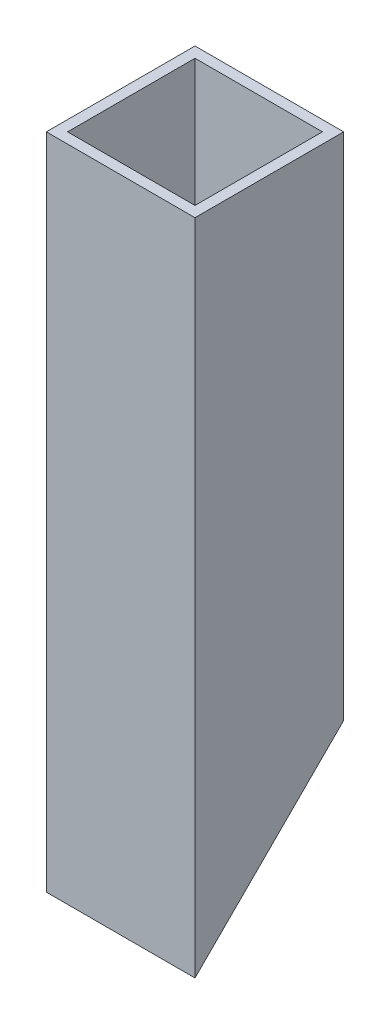
ISO-10303-21;
HEADER;
FILE_DESCRIPTION(('STEP AP214'),'2;1');
FILE_NAME('part.step','',(''),(''),'','','');
FILE_SCHEMA(('AUTOMOTIVE_DESIGN { 1 0 10303 214 1 1 1 1 }'));
ENDSEC;
DATA;
#1=APPLICATION_CONTEXT('core data for automotive mechanical design processes');
#2=APPLICATION_PROTOCOL_DEFINITION('international standard','automotive_design',2000,#1);
#3=PRODUCT_CONTEXT('',#1,'mechanical');
#4=PRODUCT('Part','Part','',(#3));
#5=PRODUCT_RELATED_PRODUCT_CATEGORY('part','',(#4));
#6=PRODUCT_DEFINITION_FORMATION('','',#4);
#7=PRODUCT_DEFINITION_CONTEXT('part definition',#1,'design');
#8=PRODUCT_DEFINITION('design','',#6,#7);
#9=PRODUCT_DEFINITION_SHAPE('','',#8);
#10=(LENGTH_UNIT() NAMED_UNIT(*) SI_UNIT(.MILLI.,.METRE.));
#11=(NAMED_UNIT(*) PLANE_ANGLE_UNIT() SI_UNIT($,.RADIAN.));
#12=(NAMED_UNIT(*) SI_UNIT($,.STERADIAN.) SOLID_ANGLE_UNIT());
#13=UNCERTAINTY_MEASURE_WITH_UNIT(LENGTH_MEASURE(1.E-05),#10,'distance_accuracy_value','');
#14=(GEOMETRIC_REPRESENTATION_CONTEXT(3) GLOBAL_UNCERTAINTY_ASSIGNED_CONTEXT((#13)) GLOBAL_UNIT_ASSIGNED_CONTEXT((#10,
#11,#12)) REPRESENTATION_CONTEXT('',''));
#15=CARTESIAN_POINT('',(0.,0.,0.));
#16=DIRECTION('',(0.,0.,1.));
#17=DIRECTION('',(1.,0.,0.));
#18=AXIS2_PLACEMENT_3D('',#15,#16,#17);
#19=CARTESIAN_POINT('',(0.,196.85,0.));
#20=DIRECTION('',(0.,-1.,0.));
#21=DIRECTION('',(0.,0.,1.));
#22=AXIS2_PLACEMENT_3D('',#19,#20,#21);
#23=PLANE('',#22);
#24=DIRECTION('',(0.,0.,-1.));
#25=VECTOR('',#24,1.);
#26=CARTESIAN_POINT('',(0.,196.85,0.));
#27=LINE('',#26,#25);
#28=CARTESIAN_POINT('',(0.,196.85,44.45));
#29=VERTEX_POINT('',#28);
#30=CARTESIAN_POINT('',(0.,196.85,0.));
#31=VERTEX_POINT('',#30);
#32=EDGE_CURVE('E149',#29,#31,#27,.T.);
#33=ORIENTED_EDGE('',*,*,#32,.F.);
#34=DIRECTION('',(-1.,0.,0.));
#35=VECTOR('',#34,1.);
#36=CARTESIAN_POINT('',(0.,196.85,44.45));
#37=LINE('',#36,#35);
#38=CARTESIAN_POINT('',(44.45,196.85,44.45));
#39=VERTEX_POINT('',#38);
#40=EDGE_CURVE('E160',#39,#29,#37,.T.);
#41=ORIENTED_EDGE('',*,*,#40,.F.);
#42=DIRECTION('',(0.,0.,1.));
#43=VECTOR('',#42,1.);
#44=CARTESIAN_POINT('',(44.45,196.85,0.));
#45=LINE('',#44,#43);
#46=CARTESIAN_POINT('',(44.45,196.85,0.));
#47=VERTEX_POINT('',#46);
#48=EDGE_CURVE('E157',#47,#39,#45,.T.);
#49=ORIENTED_EDGE('',*,*,#48,.F.);
#50=DIRECTION('',(1.,0.,0.));
#51=VECTOR('',#50,1.);
#52=CARTESIAN_POINT('',(0.,196.85,0.));
#53=LINE('',#52,#51);
#54=EDGE_CURVE('E153',#31,#47,#53,.T.);
#55=ORIENTED_EDGE('',*,*,#54,.F.);
#56=EDGE_LOOP('',(#33,#41,#49,#55));
#57=FACE_BOUND('',#56,.T.);
#58=DIRECTION('',(1.,0.,0.));
#59=VECTOR('',#58,1.);
#60=CARTESIAN_POINT('',(3.175,196.85,3.175));
#61=LINE('',#60,#59);
#62=CARTESIAN_POINT('',(3.175,196.85,3.175));
#63=VERTEX_POINT('',#62);
#64=CARTESIAN_POINT('',(41.275,196.85,3.175));
#65=VERTEX_POINT('',#64);
#66=EDGE_CURVE('E126',#63,#65,#61,.T.);
#67=ORIENTED_EDGE('',*,*,#66,.T.);
#68=DIRECTION('',(0.,0.,1.));
#69=VECTOR('',#68,1.);
#70=CARTESIAN_POINT('',(41.275,196.85,3.175));
#71=LINE('',#70,#69);
#72=CARTESIAN_POINT('',(41.275,196.85,41.275));
#73=VERTEX_POINT('',#72);
#74=EDGE_CURVE('E96',#65,#73,#71,.T.);
#75=ORIENTED_EDGE('',*,*,#74,.T.);
#76=DIRECTION('',(-1.,0.,0.));
#77=VECTOR('',#76,1.);
#78=CARTESIAN_POINT('',(3.175,196.85,41.275));
#79=LINE('',#78,#77);
#80=CARTESIAN_POINT('',(3.175,196.85,41.275));
#81=VERTEX_POINT('',#80);
#82=EDGE_CURVE('E137',#73,#81,#79,.T.);
#83=ORIENTED_EDGE('',*,*,#82,.T.);
#84=DIRECTION('',(0.,0.,-1.));
#85=VECTOR('',#84,1.);
#86=CARTESIAN_POINT('',(3.175,196.85,3.175));
#87=LINE('',#86,#85);
#88=EDGE_CURVE('E113',#81,#63,#87,.T.);
#89=ORIENTED_EDGE('',*,*,#88,.T.);
#90=EDGE_LOOP('',(#67,#75,#83,#89));
#91=FACE_BOUND('',#90,.T.);
#92=ADVANCED_FACE('F45',(#57,#91),#23,.F.);
#93=CARTESIAN_POINT('',(0.,196.85,0.));
#94=DIRECTION('',(1.,0.,0.));
#95=DIRECTION('',(0.,0.,1.));
#96=AXIS2_PLACEMENT_3D('',#93,#94,#95);
#97=PLANE('',#96);
#98=DIRECTION('',(0.,-1.,0.));
#99=VECTOR('',#98,1.);
#100=CARTESIAN_POINT('',(0.,196.85,44.45));
#101=LINE('',#100,#99);
#102=CARTESIAN_POINT('',(0.,0.,44.45));
#103=VERTEX_POINT('',#102);
#104=EDGE_CURVE('E119',#29,#103,#101,.T.);
#105=ORIENTED_EDGE('',*,*,#104,.F.);
#106=ORIENTED_EDGE('',*,*,#32,.T.);
#107=DIRECTION('',(0.,-1.,0.));
#108=VECTOR('',#107,1.);
#109=CARTESIAN_POINT('',(0.,196.85,0.));
#110=LINE('',#109,#108);
#111=CARTESIAN_POINT('',(0.,44.45,0.));
#112=VERTEX_POINT('',#111);
#113=EDGE_CURVE('E124',#31,#112,#110,.T.);
#114=ORIENTED_EDGE('',*,*,#113,.T.);
#115=DIRECTION('',(0.,0.707106781186546,-0.707106781186549));
#116=VECTOR('',#115,1.);
#117=CARTESIAN_POINT('',(0.,44.45,0.));
#118=LINE('',#117,#116);
#119=EDGE_CURVE('E11',#103,#112,#118,.T.);
#120=ORIENTED_EDGE('',*,*,#119,.F.);
#121=EDGE_LOOP('',(#105,#106,#114,#120));
#122=FACE_BOUND('',#121,.T.);
#123=ADVANCED_FACE('F217',(#122),#97,.F.);
#124=CARTESIAN_POINT('',(0.,196.85,0.));
#125=DIRECTION('',(0.,0.,1.));
#126=DIRECTION('',(-1.,0.,0.));
#127=AXIS2_PLACEMENT_3D('',#124,#125,#126);
#128=PLANE('',#127);
#129=ORIENTED_EDGE('',*,*,#113,.F.);
#130=ORIENTED_EDGE('',*,*,#54,.T.);
#131=DIRECTION('',(0.,-1.,0.));
#132=VECTOR('',#131,1.);
#133=CARTESIAN_POINT('',(44.45,196.85,0.));
#134=LINE('',#133,#132);
#135=CARTESIAN_POINT('',(44.45,44.45,0.));
#136=VERTEX_POINT('',#135);
#137=EDGE_CURVE('E118',#47,#136,#134,.T.);
#138=ORIENTED_EDGE('',*,*,#137,.T.);
#139=DIRECTION('',(1.,0.,0.));
#140=VECTOR('',#139,1.);
#141=CARTESIAN_POINT('',(44.45,44.45,0.));
#142=LINE('',#141,#140);
#143=EDGE_CURVE('E65',#112,#136,#142,.T.);
#144=ORIENTED_EDGE('',*,*,#143,.F.);
#145=EDGE_LOOP('',(#129,#130,#138,#144));
#146=FACE_BOUND('',#145,.T.);
#147=ADVANCED_FACE('F214',(#146),#128,.F.);
#148=CARTESIAN_POINT('',(44.45,196.85,0.));
#149=DIRECTION('',(-1.,0.,0.));
#150=DIRECTION('',(0.,0.,-1.));
#151=AXIS2_PLACEMENT_3D('',#148,#149,#150);
#152=PLANE('',#151);
#153=ORIENTED_EDGE('',*,*,#137,.F.);
#154=ORIENTED_EDGE('',*,*,#48,.T.);
#155=DIRECTION('',(0.,-1.,0.));
#156=VECTOR('',#155,1.);
#157=CARTESIAN_POINT('',(44.45,196.85,44.45));
#158=LINE('',#157,#156);
#159=CARTESIAN_POINT('',(44.45,0.,44.45));
#160=VERTEX_POINT('',#159);
#161=EDGE_CURVE('E115',#39,#160,#158,.T.);
#162=ORIENTED_EDGE('',*,*,#161,.T.);
#163=DIRECTION('',(0.,-0.707106781186546,0.707106781186549));
#164=VECTOR('',#163,1.);
#165=CARTESIAN_POINT('',(44.45,44.45,0.));
#166=LINE('',#165,#164);
#167=EDGE_CURVE('E56',#136,#160,#166,.T.);
#168=ORIENTED_EDGE('',*,*,#167,.F.);
#169=EDGE_LOOP('',(#153,#154,#162,#168));
#170=FACE_BOUND('',#169,.T.);
#171=ADVANCED_FACE('F187',(#170),#152,.F.);
#172=CARTESIAN_POINT('',(0.,196.85,44.45));
#173=DIRECTION('',(0.,0.,-1.));
#174=DIRECTION('',(1.,0.,0.));
#175=AXIS2_PLACEMENT_3D('',#172,#173,#174);
#176=PLANE('',#175);
#177=DIRECTION('',(-1.,0.,0.));
#178=VECTOR('',#177,1.);
#179=CARTESIAN_POINT('',(0.,0.,44.45));
#180=LINE('',#179,#178);
#181=EDGE_CURVE('E101',#160,#103,#180,.T.);
#182=ORIENTED_EDGE('',*,*,#181,.F.);
#183=ORIENTED_EDGE('',*,*,#161,.F.);
#184=ORIENTED_EDGE('',*,*,#40,.T.);
#185=ORIENTED_EDGE('',*,*,#104,.T.);
#186=EDGE_LOOP('',(#182,#183,#184,#185));
#187=FACE_BOUND('',#186,.T.);
#188=ADVANCED_FACE('F192',(#187),#176,.F.);
#189=CARTESIAN_POINT('',(3.175,196.85,3.175));
#190=DIRECTION('',(0.,0.,1.));
#191=DIRECTION('',(-1.,0.,0.));
#192=AXIS2_PLACEMENT_3D('',#189,#190,#191);
#193=PLANE('',#192);
#194=DIRECTION('',(1.,0.,0.));
#195=VECTOR('',#194,1.);
#196=CARTESIAN_POINT('',(0.,41.275,3.175));
#197=LINE('',#196,#195);
#198=CARTESIAN_POINT('',(3.175,41.275,3.175));
#199=VERTEX_POINT('',#198);
#200=CARTESIAN_POINT('',(41.275,41.275,3.175));
#201=VERTEX_POINT('',#200);
#202=EDGE_CURVE('E49',#199,#201,#197,.T.);
#203=ORIENTED_EDGE('',*,*,#202,.T.);
#204=DIRECTION('',(0.,-1.,0.));
#205=VECTOR('',#204,1.);
#206=CARTESIAN_POINT('',(41.275,196.85,3.175));
#207=LINE('',#206,#205);
#208=EDGE_CURVE('E93',#65,#201,#207,.T.);
#209=ORIENTED_EDGE('',*,*,#208,.F.);
#210=ORIENTED_EDGE('',*,*,#66,.F.);
#211=DIRECTION('',(0.,-1.,0.));
#212=VECTOR('',#211,1.);
#213=CARTESIAN_POINT('',(3.175,196.85,3.175));
#214=LINE('',#213,#212);
#215=EDGE_CURVE('E107',#63,#199,#214,.T.);
#216=ORIENTED_EDGE('',*,*,#215,.T.);
#217=EDGE_LOOP('',(#203,#209,#210,#216));
#218=FACE_BOUND('',#217,.T.);
#219=ADVANCED_FACE('F105',(#218),#193,.T.);
#220=CARTESIAN_POINT('',(41.275,196.85,3.175));
#221=DIRECTION('',(-1.,0.,0.));
#222=DIRECTION('',(0.,0.,-1.));
#223=AXIS2_PLACEMENT_3D('',#220,#221,#222);
#224=PLANE('',#223);
#225=DIRECTION('',(0.,-0.707106781186546,0.707106781186549));
#226=VECTOR('',#225,1.);
#227=CARTESIAN_POINT('',(41.275,44.45,0.));
#228=LINE('',#227,#226);
#229=CARTESIAN_POINT('',(41.275,3.17500000000018,41.275));
#230=VERTEX_POINT('',#229);
#231=EDGE_CURVE('E82',#201,#230,#228,.T.);
#232=ORIENTED_EDGE('',*,*,#231,.T.);
#233=DIRECTION('',(0.,-1.,0.));
#234=VECTOR('',#233,1.);
#235=CARTESIAN_POINT('',(41.275,196.85,41.275));
#236=LINE('',#235,#234);
#237=EDGE_CURVE('E102',#73,#230,#236,.T.);
#238=ORIENTED_EDGE('',*,*,#237,.F.);
#239=ORIENTED_EDGE('',*,*,#74,.F.);
#240=ORIENTED_EDGE('',*,*,#208,.T.);
#241=EDGE_LOOP('',(#232,#238,#239,#240));
#242=FACE_BOUND('',#241,.T.);
#243=ADVANCED_FACE('F94',(#242),#224,.T.);
#244=CARTESIAN_POINT('',(3.175,196.85,41.275));
#245=DIRECTION('',(0.,0.,-1.));
#246=DIRECTION('',(1.,0.,0.));
#247=AXIS2_PLACEMENT_3D('',#244,#245,#246);
#248=PLANE('',#247);
#249=DIRECTION('',(-1.,0.,0.));
#250=VECTOR('',#249,1.);
#251=CARTESIAN_POINT('',(0.,3.17500000000015,41.275));
#252=LINE('',#251,#250);
#253=CARTESIAN_POINT('',(3.175,3.17500000000018,41.275));
#254=VERTEX_POINT('',#253);
#255=EDGE_CURVE('E86',#230,#254,#252,.T.);
#256=ORIENTED_EDGE('',*,*,#255,.T.);
#257=DIRECTION('',(0.,-1.,0.));
#258=VECTOR('',#257,1.);
#259=CARTESIAN_POINT('',(3.175,196.85,41.275));
#260=LINE('',#259,#258);
#261=EDGE_CURVE('E112',#81,#254,#260,.T.);
#262=ORIENTED_EDGE('',*,*,#261,.F.);
#263=ORIENTED_EDGE('',*,*,#82,.F.);
#264=ORIENTED_EDGE('',*,*,#237,.T.);
#265=EDGE_LOOP('',(#256,#262,#263,#264));
#266=FACE_BOUND('',#265,.T.);
#267=ADVANCED_FACE('F209',(#266),#248,.T.);
#268=CARTESIAN_POINT('',(3.175,196.85,3.175));
#269=DIRECTION('',(1.,0.,0.));
#270=DIRECTION('',(0.,0.,1.));
#271=AXIS2_PLACEMENT_3D('',#268,#269,#270);
#272=PLANE('',#271);
#273=DIRECTION('',(0.,0.707106781186546,-0.707106781186549));
#274=VECTOR('',#273,1.);
#275=CARTESIAN_POINT('',(3.175,44.45,0.));
#276=LINE('',#275,#274);
#277=EDGE_CURVE('E128',#254,#199,#276,.T.);
#278=ORIENTED_EDGE('',*,*,#277,.T.);
#279=ORIENTED_EDGE('',*,*,#215,.F.);
#280=ORIENTED_EDGE('',*,*,#88,.F.);
#281=ORIENTED_EDGE('',*,*,#261,.T.);
#282=EDGE_LOOP('',(#278,#279,#280,#281));
#283=FACE_BOUND('',#282,.T.);
#284=ADVANCED_FACE('F208',(#283),#272,.T.);
#285=CARTESIAN_POINT('',(0.,44.45,0.));
#286=DIRECTION('',(0.,-0.707106781186549,-0.707106781186546));
#287=DIRECTION('',(-1.,0.,0.));
#288=AXIS2_PLACEMENT_3D('',#285,#286,#287);
#289=PLANE('',#288);
#290=ORIENTED_EDGE('',*,*,#119,.T.);
#291=ORIENTED_EDGE('',*,*,#143,.T.);
#292=ORIENTED_EDGE('',*,*,#167,.T.);
#293=ORIENTED_EDGE('',*,*,#181,.T.);
#294=EDGE_LOOP('',(#290,#291,#292,#293));
#295=FACE_BOUND('',#294,.T.);
#296=ORIENTED_EDGE('',*,*,#277,.F.);
#297=ORIENTED_EDGE('',*,*,#255,.F.);
#298=ORIENTED_EDGE('',*,*,#231,.F.);
#299=ORIENTED_EDGE('',*,*,#202,.F.);
#300=EDGE_LOOP('',(#296,#297,#298,#299));
#301=FACE_BOUND('',#300,.T.);
#302=ADVANCED_FACE('F47',(#295,#301),#289,.T.);
#303=CLOSED_SHELL('',(#92,#123,#147,#171,#188,#219,#243,#267,#284,#302));
#304=MANIFOLD_SOLID_BREP('B2',#303);
#305=ADVANCED_BREP_SHAPE_REPRESENTATION('',(#18,#304),#14);
#306=SHAPE_DEFINITION_REPRESENTATION(#9,#305);
ENDSEC;
END-ISO-10303-21;
